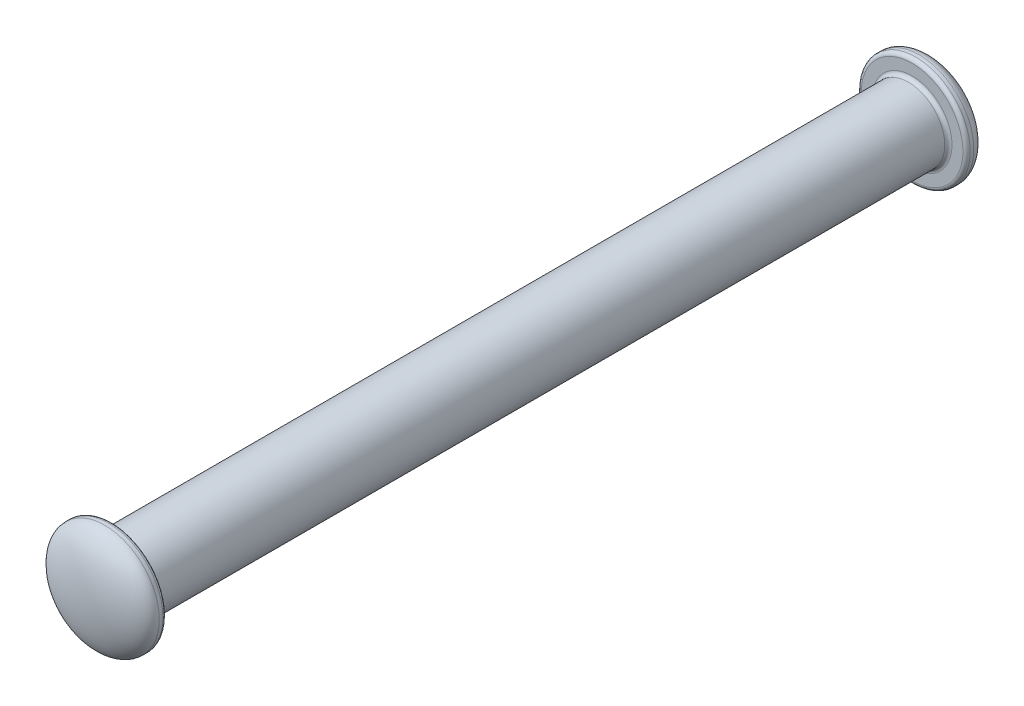
ISO-10303-21;
HEADER;
FILE_DESCRIPTION(('STEP AP214'),'2;1');
FILE_NAME('part.step','',(''),(''),'','','');
FILE_SCHEMA(('AUTOMOTIVE_DESIGN { 1 0 10303 214 1 1 1 1 }'));
ENDSEC;
DATA;
#1=APPLICATION_CONTEXT('core data for automotive mechanical design processes');
#2=APPLICATION_PROTOCOL_DEFINITION('international standard','automotive_design',2000,#1);
#3=PRODUCT_CONTEXT('',#1,'mechanical');
#4=PRODUCT('Part','Part','',(#3));
#5=PRODUCT_RELATED_PRODUCT_CATEGORY('part','',(#4));
#6=PRODUCT_DEFINITION_FORMATION('','',#4);
#7=PRODUCT_DEFINITION_CONTEXT('part definition',#1,'design');
#8=PRODUCT_DEFINITION('design','',#6,#7);
#9=PRODUCT_DEFINITION_SHAPE('','',#8);
#10=(LENGTH_UNIT() NAMED_UNIT(*) SI_UNIT(.MILLI.,.METRE.));
#11=(NAMED_UNIT(*) PLANE_ANGLE_UNIT() SI_UNIT($,.RADIAN.));
#12=(NAMED_UNIT(*) SI_UNIT($,.STERADIAN.) SOLID_ANGLE_UNIT());
#13=UNCERTAINTY_MEASURE_WITH_UNIT(LENGTH_MEASURE(1.E-05),#10,'distance_accuracy_value','');
#14=(GEOMETRIC_REPRESENTATION_CONTEXT(3) GLOBAL_UNCERTAINTY_ASSIGNED_CONTEXT((#13)) GLOBAL_UNIT_ASSIGNED_CONTEXT((#10,
#11,#12)) REPRESENTATION_CONTEXT('',''));
#15=CARTESIAN_POINT('',(0.,0.,0.));
#16=DIRECTION('',(0.,0.,1.));
#17=DIRECTION('',(1.,0.,0.));
#18=AXIS2_PLACEMENT_3D('',#15,#16,#17);
#19=CARTESIAN_POINT('',(0.,0.,11.));
#20=DIRECTION('',(0.,0.,-1.));
#21=DIRECTION('',(-1.,0.,0.));
#22=AXIS2_PLACEMENT_3D('',#19,#20,#21);
#23=CYLINDRICAL_SURFACE('',#22,0.5);
#24=CARTESIAN_POINT('',(0.,0.,10.95));
#25=DIRECTION('',(0.,0.,1.));
#26=DIRECTION('',(1.,0.,0.));
#27=AXIS2_PLACEMENT_3D('',#24,#25,#26);
#28=CIRCLE('',#27,0.5);
#29=CARTESIAN_POINT('',(0.5,0.,10.95));
#30=VERTEX_POINT('',#29);
#31=EDGE_CURVE('E83',#30,#30,#28,.F.);
#32=ORIENTED_EDGE('',*,*,#31,.T.);
#33=EDGE_LOOP('',(#32));
#34=FACE_BOUND('',#33,.T.);
#35=CARTESIAN_POINT('',(0.,0.,0.0499999999999997));
#36=DIRECTION('',(0.,0.,-1.));
#37=DIRECTION('',(-1.,0.,0.));
#38=AXIS2_PLACEMENT_3D('',#35,#36,#37);
#39=CIRCLE('',#38,0.5);
#40=CARTESIAN_POINT('',(-0.5,0.,0.0499999999999997));
#41=VERTEX_POINT('',#40);
#42=EDGE_CURVE('E80',#41,#41,#39,.F.);
#43=ORIENTED_EDGE('',*,*,#42,.T.);
#44=EDGE_LOOP('',(#43));
#45=FACE_BOUND('',#44,.T.);
#46=ADVANCED_FACE('F32',(#34,#45),#23,.T.);
#47=CARTESIAN_POINT('',(0.,0.,11.));
#48=DIRECTION('',(0.,0.,1.));
#49=DIRECTION('',(1.,0.,0.));
#50=AXIS2_PLACEMENT_3D('',#47,#48,#49);
#51=PLANE('',#50);
#52=CARTESIAN_POINT('',(0.,0.,11.));
#53=DIRECTION('',(0.,0.,1.));
#54=DIRECTION('',(1.,0.,0.));
#55=AXIS2_PLACEMENT_3D('',#52,#53,#54);
#56=CIRCLE('',#55,0.55);
#57=CARTESIAN_POINT('',(0.55,0.,11.));
#58=VERTEX_POINT('',#57);
#59=EDGE_CURVE('E77',#58,#58,#56,.T.);
#60=ORIENTED_EDGE('',*,*,#59,.T.);
#61=EDGE_LOOP('',(#60));
#62=FACE_BOUND('',#61,.T.);
#63=CARTESIAN_POINT('',(0.,0.,11.));
#64=DIRECTION('',(0.,0.,1.));
#65=DIRECTION('',(1.,0.,0.));
#66=AXIS2_PLACEMENT_3D('',#63,#64,#65);
#67=CIRCLE('',#66,0.7);
#68=CARTESIAN_POINT('',(0.7,0.,11.));
#69=VERTEX_POINT('',#68);
#70=EDGE_CURVE('E59',#69,#69,#67,.F.);
#71=ORIENTED_EDGE('',*,*,#70,.T.);
#72=EDGE_LOOP('',(#71));
#73=FACE_BOUND('',#72,.T.);
#74=ADVANCED_FACE('F108',(#62,#73),#51,.F.);
#75=CARTESIAN_POINT('',(0.,0.,11.1));
#76=DIRECTION('',(0.,0.,-1.));
#77=DIRECTION('',(-1.,0.,0.));
#78=AXIS2_PLACEMENT_3D('',#75,#76,#77);
#79=CYLINDRICAL_SURFACE('',#78,0.75);
#80=CARTESIAN_POINT('',(0.,0.,11.05));
#81=DIRECTION('',(0.,0.,1.));
#82=DIRECTION('',(1.,0.,0.));
#83=AXIS2_PLACEMENT_3D('',#80,#81,#82);
#84=CIRCLE('',#83,0.75);
#85=CARTESIAN_POINT('',(0.75,0.,11.05));
#86=VERTEX_POINT('',#85);
#87=EDGE_CURVE('E86',#86,#86,#84,.T.);
#88=ORIENTED_EDGE('',*,*,#87,.T.);
#89=EDGE_LOOP('',(#88));
#90=FACE_BOUND('',#89,.T.);
#91=CARTESIAN_POINT('',(0.,0.,11.1));
#92=DIRECTION('',(0.,0.,1.));
#93=DIRECTION('',(1.,0.,0.));
#94=AXIS2_PLACEMENT_3D('',#91,#92,#93);
#95=CIRCLE('',#94,0.75);
#96=CARTESIAN_POINT('',(0.75,0.,11.1));
#97=VERTEX_POINT('',#96);
#98=EDGE_CURVE('E56',#97,#97,#95,.T.);
#99=ORIENTED_EDGE('',*,*,#98,.F.);
#100=EDGE_LOOP('',(#99));
#101=FACE_BOUND('',#100,.T.);
#102=ADVANCED_FACE('F71',(#90,#101),#79,.T.);
#103=CARTESIAN_POINT('',(0.,0.,11.1));
#104=DIRECTION('',(0.,1.,0.));
#105=DIRECTION('',(1.,0.,0.));
#106=AXIS2_PLACEMENT_3D('',#103,#104,#105);
#107=ELLIPSE('',#106,0.75,0.3);
#108=TRIMMED_CURVE('',#107,(PARAMETER_VALUE(4.71238898038469)),
(PARAMETER_VALUE(7.85398163397448)),.T.,.PARAMETER.);
#109=CARTESIAN_POINT('',(0.,0.,10.8));
#110=DIRECTION('',(0.,0.,1.));
#111=AXIS1_PLACEMENT('',#109,#110);
#112=SURFACE_OF_REVOLUTION('',#108,#111);
#113=CARTESIAN_POINT('',(0.,0.,11.4));
#114=VERTEX_POINT('',#113);
#115=VERTEX_LOOP('',#114);
#116=FACE_BOUND('',#115,.T.);
#117=ORIENTED_EDGE('',*,*,#98,.T.);
#118=EDGE_LOOP('',(#117));
#119=FACE_BOUND('',#118,.T.);
#120=ADVANCED_FACE('F67',(#116,#119),#112,.F.);
#121=CARTESIAN_POINT('',(0.,0.,0.));
#122=DIRECTION('',(0.,0.,-1.));
#123=DIRECTION('',(-1.,0.,0.));
#124=AXIS2_PLACEMENT_3D('',#121,#122,#123);
#125=PLANE('',#124);
#126=CARTESIAN_POINT('',(0.,0.,0.));
#127=DIRECTION('',(0.,0.,-1.));
#128=DIRECTION('',(-1.,0.,0.));
#129=AXIS2_PLACEMENT_3D('',#126,#127,#128);
#130=CIRCLE('',#129,0.55);
#131=CARTESIAN_POINT('',(-0.55,0.,0.));
#132=VERTEX_POINT('',#131);
#133=EDGE_CURVE('E40',#132,#132,#130,.T.);
#134=ORIENTED_EDGE('',*,*,#133,.T.);
#135=EDGE_LOOP('',(#134));
#136=FACE_BOUND('',#135,.T.);
#137=CARTESIAN_POINT('',(0.,0.,0.));
#138=DIRECTION('',(0.,0.,-1.));
#139=DIRECTION('',(-1.,0.,0.));
#140=AXIS2_PLACEMENT_3D('',#137,#138,#139);
#141=CIRCLE('',#140,0.7);
#142=CARTESIAN_POINT('',(-0.7,0.,0.));
#143=VERTEX_POINT('',#142);
#144=EDGE_CURVE('E89',#143,#143,#141,.F.);
#145=ORIENTED_EDGE('',*,*,#144,.T.);
#146=EDGE_LOOP('',(#145));
#147=FACE_BOUND('',#146,.T.);
#148=ADVANCED_FACE('F70',(#136,#147),#125,.F.);
#149=CARTESIAN_POINT('',(0.,0.,-0.1));
#150=DIRECTION('',(0.,0.,1.));
#151=DIRECTION('',(1.,0.,0.));
#152=AXIS2_PLACEMENT_3D('',#149,#150,#151);
#153=CYLINDRICAL_SURFACE('',#152,0.75);
#154=CARTESIAN_POINT('',(0.,0.,-0.05));
#155=DIRECTION('',(0.,0.,-1.));
#156=DIRECTION('',(-1.,0.,0.));
#157=AXIS2_PLACEMENT_3D('',#154,#155,#156);
#158=CIRCLE('',#157,0.75);
#159=CARTESIAN_POINT('',(-0.75,0.,-0.05));
#160=VERTEX_POINT('',#159);
#161=EDGE_CURVE('E11',#160,#160,#158,.T.);
#162=ORIENTED_EDGE('',*,*,#161,.T.);
#163=EDGE_LOOP('',(#162));
#164=FACE_BOUND('',#163,.T.);
#165=CARTESIAN_POINT('',(0.,0.,-0.1));
#166=DIRECTION('',(0.,0.,-1.));
#167=DIRECTION('',(-1.,0.,0.));
#168=AXIS2_PLACEMENT_3D('',#165,#166,#167);
#169=CIRCLE('',#168,0.75);
#170=CARTESIAN_POINT('',(-0.75,0.,-0.1));
#171=VERTEX_POINT('',#170);
#172=EDGE_CURVE('E54',#171,#171,#169,.T.);
#173=ORIENTED_EDGE('',*,*,#172,.F.);
#174=EDGE_LOOP('',(#173));
#175=FACE_BOUND('',#174,.T.);
#176=ADVANCED_FACE('F50',(#164,#175),#153,.T.);
#177=CARTESIAN_POINT('',(0.,0.,-0.1));
#178=DIRECTION('',(0.,1.,0.));
#179=DIRECTION('',(-1.,0.,0.));
#180=AXIS2_PLACEMENT_3D('',#177,#178,#179);
#181=ELLIPSE('',#180,0.75,0.3);
#182=TRIMMED_CURVE('',#181,(PARAMETER_VALUE(4.71238898038469)),
(PARAMETER_VALUE(7.85398163397448)),.T.,.PARAMETER.);
#183=CARTESIAN_POINT('',(0.,0.,0.2));
#184=DIRECTION('',(0.,0.,-1.));
#185=AXIS1_PLACEMENT('',#183,#184);
#186=SURFACE_OF_REVOLUTION('',#182,#185);
#187=CARTESIAN_POINT('',(0.,0.,-0.4));
#188=VERTEX_POINT('',#187);
#189=VERTEX_LOOP('',#188);
#190=FACE_BOUND('',#189,.T.);
#191=ORIENTED_EDGE('',*,*,#172,.T.);
#192=EDGE_LOOP('',(#191));
#193=FACE_BOUND('',#192,.T.);
#194=ADVANCED_FACE('F46',(#190,#193),#186,.F.);
#195=CARTESIAN_POINT('',(0.,0.,10.95));
#196=DIRECTION('',(0.,0.,1.));
#197=DIRECTION('',(1.,0.,0.));
#198=AXIS2_PLACEMENT_3D('',#195,#196,#197);
#199=TOROIDAL_SURFACE('',#198,0.55,0.05);
#200=ORIENTED_EDGE('',*,*,#31,.F.);
#201=EDGE_LOOP('',(#200));
#202=FACE_BOUND('',#201,.T.);
#203=ORIENTED_EDGE('',*,*,#59,.F.);
#204=EDGE_LOOP('',(#203));
#205=FACE_BOUND('',#204,.T.);
#206=ADVANCED_FACE('F49',(#202,#205),#199,.F.);
#207=CARTESIAN_POINT('',(0.,0.,11.05));
#208=DIRECTION('',(0.,0.,1.));
#209=DIRECTION('',(1.,0.,0.));
#210=AXIS2_PLACEMENT_3D('',#207,#208,#209);
#211=TOROIDAL_SURFACE('',#210,0.7,0.05);
#212=ORIENTED_EDGE('',*,*,#70,.F.);
#213=EDGE_LOOP('',(#212));
#214=FACE_BOUND('',#213,.T.);
#215=ORIENTED_EDGE('',*,*,#87,.F.);
#216=EDGE_LOOP('',(#215));
#217=FACE_BOUND('',#216,.T.);
#218=ADVANCED_FACE('F98',(#214,#217),#211,.T.);
#219=CARTESIAN_POINT('',(0.,0.,0.0499999999999997));
#220=DIRECTION('',(0.,0.,-1.));
#221=DIRECTION('',(-1.,0.,0.));
#222=AXIS2_PLACEMENT_3D('',#219,#220,#221);
#223=TOROIDAL_SURFACE('',#222,0.55,0.05);
#224=ORIENTED_EDGE('',*,*,#42,.F.);
#225=EDGE_LOOP('',(#224));
#226=FACE_BOUND('',#225,.T.);
#227=ORIENTED_EDGE('',*,*,#133,.F.);
#228=EDGE_LOOP('',(#227));
#229=FACE_BOUND('',#228,.T.);
#230=ADVANCED_FACE('F96',(#226,#229),#223,.F.);
#231=CARTESIAN_POINT('',(0.,0.,-0.05));
#232=DIRECTION('',(0.,0.,-1.));
#233=DIRECTION('',(-1.,0.,0.));
#234=AXIS2_PLACEMENT_3D('',#231,#232,#233);
#235=TOROIDAL_SURFACE('',#234,0.7,0.05);
#236=ORIENTED_EDGE('',*,*,#144,.F.);
#237=EDGE_LOOP('',(#236));
#238=FACE_BOUND('',#237,.T.);
#239=ORIENTED_EDGE('',*,*,#161,.F.);
#240=EDGE_LOOP('',(#239));
#241=FACE_BOUND('',#240,.T.);
#242=ADVANCED_FACE('F34',(#238,#241),#235,.T.);
#243=CLOSED_SHELL('',(#46,#74,#102,#120,#148,#176,#194,#206,#218,#230,#242));
#244=MANIFOLD_SOLID_BREP('B2',#243);
#245=ADVANCED_BREP_SHAPE_REPRESENTATION('',(#18,#244),#14);
#246=SHAPE_DEFINITION_REPRESENTATION(#9,#245);
ENDSEC;
END-ISO-10303-21;
